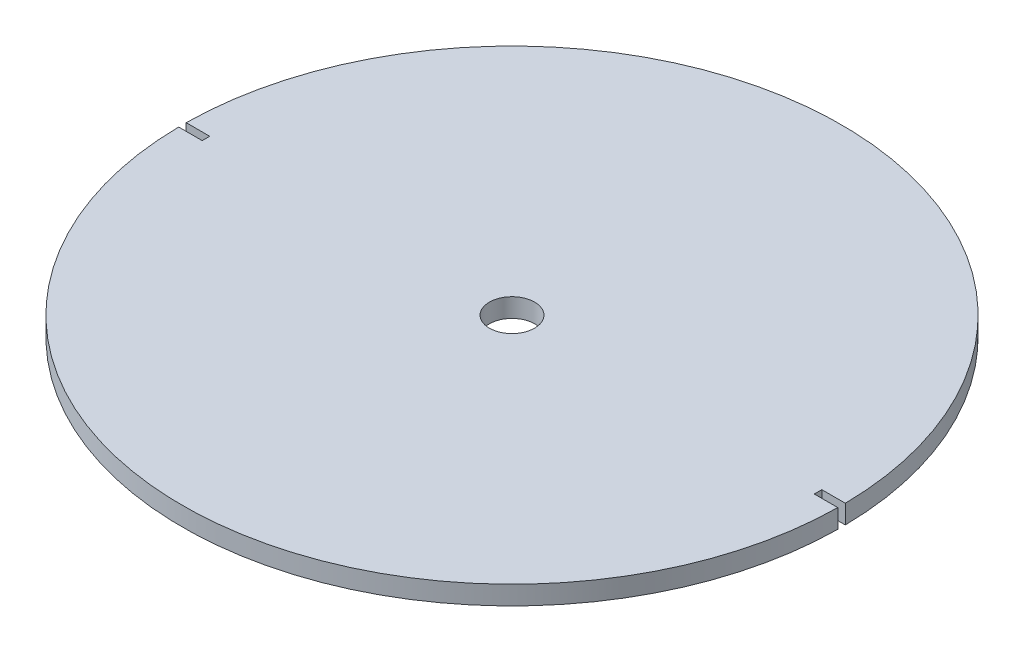
ISO-10303-21;
HEADER;
FILE_DESCRIPTION(('STEP AP214'),'2;1');
FILE_NAME('part.step','',(''),(''),'','','');
FILE_SCHEMA(('AUTOMOTIVE_DESIGN { 1 0 10303 214 1 1 1 1 }'));
ENDSEC;
DATA;
#1=APPLICATION_CONTEXT('core data for automotive mechanical design processes');
#2=APPLICATION_PROTOCOL_DEFINITION('international standard','automotive_design',2000,#1);
#3=PRODUCT_CONTEXT('',#1,'mechanical');
#4=PRODUCT('Part','Part','',(#3));
#5=PRODUCT_RELATED_PRODUCT_CATEGORY('part','',(#4));
#6=PRODUCT_DEFINITION_FORMATION('','',#4);
#7=PRODUCT_DEFINITION_CONTEXT('part definition',#1,'design');
#8=PRODUCT_DEFINITION('design','',#6,#7);
#9=PRODUCT_DEFINITION_SHAPE('','',#8);
#10=(LENGTH_UNIT() NAMED_UNIT(*) SI_UNIT(.MILLI.,.METRE.));
#11=(NAMED_UNIT(*) PLANE_ANGLE_UNIT() SI_UNIT($,.RADIAN.));
#12=(NAMED_UNIT(*) SI_UNIT($,.STERADIAN.) SOLID_ANGLE_UNIT());
#13=UNCERTAINTY_MEASURE_WITH_UNIT(LENGTH_MEASURE(1.E-05),#10,'distance_accuracy_value','');
#14=(GEOMETRIC_REPRESENTATION_CONTEXT(3) GLOBAL_UNCERTAINTY_ASSIGNED_CONTEXT((#13)) GLOBAL_UNIT_ASSIGNED_CONTEXT((#10,
#11,#12)) REPRESENTATION_CONTEXT('',''));
#15=CARTESIAN_POINT('',(0.,0.,0.));
#16=DIRECTION('',(0.,0.,1.));
#17=DIRECTION('',(1.,0.,0.));
#18=AXIS2_PLACEMENT_3D('',#15,#16,#17);
#19=CARTESIAN_POINT('',(0.,0.,0.));
#20=DIRECTION('',(0.,1.,0.));
#21=DIRECTION('',(0.,0.,1.));
#22=AXIS2_PLACEMENT_3D('',#19,#20,#21);
#23=PLANE('',#22);
#24=CARTESIAN_POINT('',(0.,0.,0.));
#25=DIRECTION('',(0.,1.,0.));
#26=DIRECTION('',(0.,0.,1.));
#27=AXIS2_PLACEMENT_3D('',#24,#25,#26);
#28=CIRCLE('',#27,2.4);
#29=CARTESIAN_POINT('',(0.,0.,2.4));
#30=VERTEX_POINT('',#29);
#31=EDGE_CURVE('E285',#30,#30,#28,.T.);
#32=ORIENTED_EDGE('',*,*,#31,.T.);
#33=EDGE_LOOP('',(#32));
#34=FACE_BOUND('',#33,.T.);
#35=DIRECTION('',(-0.866025403784439,0.,-0.5));
#36=VECTOR('',#35,1.);
#37=CARTESIAN_POINT('',(0.,0.,24.1143593539449));
#38=LINE('',#37,#36);
#39=CARTESIAN_POINT('',(0.,0.,24.1143593539449));
#40=VERTEX_POINT('',#39);
#41=CARTESIAN_POINT('',(-20.8836477965032,0.,12.0571796769724));
#42=VERTEX_POINT('',#41);
#43=EDGE_CURVE('E221',#40,#42,#38,.T.);
#44=ORIENTED_EDGE('',*,*,#43,.T.);
#45=DIRECTION('',(0.,0.,-1.));
#46=VECTOR('',#45,1.);
#47=CARTESIAN_POINT('',(-20.8836477965032,0.,12.0571796769724));
#48=LINE('',#47,#46);
#49=CARTESIAN_POINT('',(-20.8836477965032,0.,-12.0571796769724));
#50=VERTEX_POINT('',#49);
#51=EDGE_CURVE('E186',#42,#50,#48,.T.);
#52=ORIENTED_EDGE('',*,*,#51,.T.);
#53=DIRECTION('',(0.866025403784439,0.,-0.5));
#54=VECTOR('',#53,1.);
#55=CARTESIAN_POINT('',(-20.8836477965032,0.,-12.0571796769724));
#56=LINE('',#55,#54);
#57=CARTESIAN_POINT('',(0.,0.,-24.1143593539449));
#58=VERTEX_POINT('',#57);
#59=EDGE_CURVE('E66',#50,#58,#56,.T.);
#60=ORIENTED_EDGE('',*,*,#59,.T.);
#61=DIRECTION('',(0.866025403784439,0.,0.5));
#62=VECTOR('',#61,1.);
#63=CARTESIAN_POINT('',(0.,0.,-24.1143593539449));
#64=LINE('',#63,#62);
#65=CARTESIAN_POINT('',(20.8836477965032,0.,-12.0571796769724));
#66=VERTEX_POINT('',#65);
#67=EDGE_CURVE('E225',#58,#66,#64,.T.);
#68=ORIENTED_EDGE('',*,*,#67,.T.);
#69=DIRECTION('',(0.,0.,1.));
#70=VECTOR('',#69,1.);
#71=CARTESIAN_POINT('',(20.8836477965032,0.,-12.0571796769724));
#72=LINE('',#71,#70);
#73=CARTESIAN_POINT('',(20.8836477965032,0.,12.0571796769725));
#74=VERTEX_POINT('',#73);
#75=EDGE_CURVE('E210',#66,#74,#72,.T.);
#76=ORIENTED_EDGE('',*,*,#75,.T.);
#77=DIRECTION('',(-0.866025403784439,0.,0.5));
#78=VECTOR('',#77,1.);
#79=CARTESIAN_POINT('',(20.8836477965032,0.,12.0571796769725));
#80=LINE('',#79,#78);
#81=EDGE_CURVE('E207',#74,#40,#80,.T.);
#82=ORIENTED_EDGE('',*,*,#81,.T.);
#83=EDGE_LOOP('',(#44,#52,#60,#68,#76,#82));
#84=FACE_BOUND('',#83,.T.);
#85=ADVANCED_FACE('F43',(#34,#84),#23,.F.);
#86=CARTESIAN_POINT('',(0.,2.,0.));
#87=DIRECTION('',(0.,-1.,0.));
#88=DIRECTION('',(0.,0.,-1.));
#89=AXIS2_PLACEMENT_3D('',#86,#87,#88);
#90=CYLINDRICAL_SURFACE('',#89,35.);
#91=CARTESIAN_POINT('',(0.,0.,0.));
#92=DIRECTION('',(0.,1.,0.));
#93=DIRECTION('',(0.,0.,1.));
#94=AXIS2_PLACEMENT_3D('',#91,#92,#93);
#95=CIRCLE('',#94,35.);
#96=CARTESIAN_POINT('',(34.9977142110739,0.,-0.4));
#97=VERTEX_POINT('',#96);
#98=CARTESIAN_POINT('',(-34.9977142110739,0.,-0.4));
#99=VERTEX_POINT('',#98);
#100=EDGE_CURVE('E343',#97,#99,#95,.T.);
#101=ORIENTED_EDGE('',*,*,#100,.T.);
#102=DIRECTION('',(0.,-1.,0.));
#103=VECTOR('',#102,1.);
#104=CARTESIAN_POINT('',(-34.9977142110739,2.,-0.4));
#105=LINE('',#104,#103);
#106=CARTESIAN_POINT('',(-34.9977142110739,2.,-0.4));
#107=VERTEX_POINT('',#106);
#108=EDGE_CURVE('E335',#99,#107,#105,.F.);
#109=ORIENTED_EDGE('',*,*,#108,.T.);
#110=CARTESIAN_POINT('',(0.,2.,0.));
#111=DIRECTION('',(0.,1.,0.));
#112=DIRECTION('',(0.,0.,1.));
#113=AXIS2_PLACEMENT_3D('',#110,#111,#112);
#114=CIRCLE('',#113,35.);
#115=CARTESIAN_POINT('',(34.9977142110739,2.,-0.4));
#116=VERTEX_POINT('',#115);
#117=EDGE_CURVE('E342',#116,#107,#114,.T.);
#118=ORIENTED_EDGE('',*,*,#117,.F.);
#119=DIRECTION('',(0.,-1.,0.));
#120=VECTOR('',#119,1.);
#121=CARTESIAN_POINT('',(34.9977142110739,2.,-0.4));
#122=LINE('',#121,#120);
#123=EDGE_CURVE('E308',#116,#97,#122,.T.);
#124=ORIENTED_EDGE('',*,*,#123,.T.);
#125=EDGE_LOOP('',(#101,#109,#118,#124));
#126=FACE_BOUND('',#125,.T.);
#127=ADVANCED_FACE('F358',(#126),#90,.T.);
#128=CARTESIAN_POINT('',(-34.9977142110739,2.,0.4));
#129=VERTEX_POINT('',#128);
#130=CARTESIAN_POINT('',(34.9977142110739,2.,0.4));
#131=VERTEX_POINT('',#130);
#132=EDGE_CURVE('E339',#129,#131,#114,.T.);
#133=ORIENTED_EDGE('',*,*,#132,.F.);
#134=DIRECTION('',(0.,-1.,0.));
#135=VECTOR('',#134,1.);
#136=CARTESIAN_POINT('',(-34.9977142110739,2.,0.4));
#137=LINE('',#136,#135);
#138=CARTESIAN_POINT('',(-34.9977142110739,0.,0.4));
#139=VERTEX_POINT('',#138);
#140=EDGE_CURVE('E332',#129,#139,#137,.T.);
#141=ORIENTED_EDGE('',*,*,#140,.T.);
#142=CARTESIAN_POINT('',(34.9977142110739,0.,0.4));
#143=VERTEX_POINT('',#142);
#144=EDGE_CURVE('E338',#139,#143,#95,.T.);
#145=ORIENTED_EDGE('',*,*,#144,.T.);
#146=DIRECTION('',(0.,-1.,0.));
#147=VECTOR('',#146,1.);
#148=CARTESIAN_POINT('',(34.9977142110739,2.,0.4));
#149=LINE('',#148,#147);
#150=EDGE_CURVE('E329',#143,#131,#149,.F.);
#151=ORIENTED_EDGE('',*,*,#150,.T.);
#152=EDGE_LOOP('',(#133,#141,#145,#151));
#153=FACE_BOUND('',#152,.T.);
#154=ADVANCED_FACE('F45',(#153),#90,.T.);
#155=CARTESIAN_POINT('',(0.,2.,0.));
#156=DIRECTION('',(0.,1.,0.));
#157=DIRECTION('',(0.,0.,1.));
#158=AXIS2_PLACEMENT_3D('',#155,#156,#157);
#159=PLANE('',#158);
#160=CARTESIAN_POINT('',(0.,2.,0.));
#161=DIRECTION('',(0.,1.,0.));
#162=DIRECTION('',(0.,0.,1.));
#163=AXIS2_PLACEMENT_3D('',#160,#161,#162);
#164=CIRCLE('',#163,2.4);
#165=CARTESIAN_POINT('',(0.,2.,2.4));
#166=VERTEX_POINT('',#165);
#167=EDGE_CURVE('E275',#166,#166,#164,.T.);
#168=ORIENTED_EDGE('',*,*,#167,.F.);
#169=EDGE_LOOP('',(#168));
#170=FACE_BOUND('',#169,.T.);
#171=DIRECTION('',(-1.,0.,0.));
#172=VECTOR('',#171,1.);
#173=CARTESIAN_POINT('',(-37.5,2.,-0.4));
#174=LINE('',#173,#172);
#175=CARTESIAN_POINT('',(-32.5,2.,-0.4));
#176=VERTEX_POINT('',#175);
#177=EDGE_CURVE('E295',#176,#107,#174,.T.);
#178=ORIENTED_EDGE('',*,*,#177,.F.);
#179=DIRECTION('',(0.,0.,-1.));
#180=VECTOR('',#179,1.);
#181=CARTESIAN_POINT('',(-32.5,2.,-0.4));
#182=LINE('',#181,#180);
#183=CARTESIAN_POINT('',(-32.5,2.,0.4));
#184=VERTEX_POINT('',#183);
#185=EDGE_CURVE('E301',#184,#176,#182,.T.);
#186=ORIENTED_EDGE('',*,*,#185,.F.);
#187=DIRECTION('',(1.,0.,0.));
#188=VECTOR('',#187,1.);
#189=CARTESIAN_POINT('',(-37.5,2.,0.4));
#190=LINE('',#189,#188);
#191=EDGE_CURVE('E299',#129,#184,#190,.T.);
#192=ORIENTED_EDGE('',*,*,#191,.F.);
#193=ORIENTED_EDGE('',*,*,#132,.T.);
#194=DIRECTION('',(1.,0.,0.));
#195=VECTOR('',#194,1.);
#196=CARTESIAN_POINT('',(37.5,2.,0.4));
#197=LINE('',#196,#195);
#198=CARTESIAN_POINT('',(32.5,2.,0.4));
#199=VERTEX_POINT('',#198);
#200=EDGE_CURVE('E316',#199,#131,#197,.T.);
#201=ORIENTED_EDGE('',*,*,#200,.F.);
#202=DIRECTION('',(0.,0.,1.));
#203=VECTOR('',#202,1.);
#204=CARTESIAN_POINT('',(32.5,2.,-0.4));
#205=LINE('',#204,#203);
#206=CARTESIAN_POINT('',(32.5,2.,-0.4));
#207=VERTEX_POINT('',#206);
#208=EDGE_CURVE('E318',#207,#199,#205,.T.);
#209=ORIENTED_EDGE('',*,*,#208,.F.);
#210=DIRECTION('',(-1.,0.,0.));
#211=VECTOR('',#210,1.);
#212=CARTESIAN_POINT('',(37.5,2.,-0.4));
#213=LINE('',#212,#211);
#214=EDGE_CURVE('E302',#116,#207,#213,.T.);
#215=ORIENTED_EDGE('',*,*,#214,.F.);
#216=ORIENTED_EDGE('',*,*,#117,.T.);
#217=EDGE_LOOP('',(#178,#186,#192,#193,#201,#209,#215,#216));
#218=FACE_BOUND('',#217,.T.);
#219=ADVANCED_FACE('F353',(#170,#218),#159,.T.);
#220=DIRECTION('',(0.,0.,-1.));
#221=VECTOR('',#220,1.);
#222=CARTESIAN_POINT('',(-22.0836477965032,0.,12.75));
#223=LINE('',#222,#221);
#224=CARTESIAN_POINT('',(-22.0836477965032,0.,12.75));
#225=VERTEX_POINT('',#224);
#226=CARTESIAN_POINT('',(-22.0836477965032,0.,-12.75));
#227=VERTEX_POINT('',#226);
#228=EDGE_CURVE('E259',#225,#227,#223,.T.);
#229=ORIENTED_EDGE('',*,*,#228,.F.);
#230=DIRECTION('',(-0.866025403784439,0.,-0.5));
#231=VECTOR('',#230,1.);
#232=CARTESIAN_POINT('',(0.,0.,25.5));
#233=LINE('',#232,#231);
#234=CARTESIAN_POINT('',(0.,0.,25.5));
#235=VERTEX_POINT('',#234);
#236=EDGE_CURVE('E58',#235,#225,#233,.T.);
#237=ORIENTED_EDGE('',*,*,#236,.F.);
#238=DIRECTION('',(-0.866025403784439,0.,0.5));
#239=VECTOR('',#238,1.);
#240=CARTESIAN_POINT('',(22.0836477965032,0.,12.75));
#241=LINE('',#240,#239);
#242=CARTESIAN_POINT('',(22.0836477965032,0.,12.75));
#243=VERTEX_POINT('',#242);
#244=EDGE_CURVE('E242',#243,#235,#241,.T.);
#245=ORIENTED_EDGE('',*,*,#244,.F.);
#246=DIRECTION('',(0.,0.,1.));
#247=VECTOR('',#246,1.);
#248=CARTESIAN_POINT('',(22.0836477965032,0.,-12.75));
#249=LINE('',#248,#247);
#250=CARTESIAN_POINT('',(22.0836477965032,0.,-12.75));
#251=VERTEX_POINT('',#250);
#252=EDGE_CURVE('E268',#251,#243,#249,.T.);
#253=ORIENTED_EDGE('',*,*,#252,.F.);
#254=DIRECTION('',(0.866025403784439,0.,0.5));
#255=VECTOR('',#254,1.);
#256=CARTESIAN_POINT('',(0.,0.,-25.5));
#257=LINE('',#256,#255);
#258=CARTESIAN_POINT('',(0.,0.,-25.5));
#259=VERTEX_POINT('',#258);
#260=EDGE_CURVE('E265',#259,#251,#257,.T.);
#261=ORIENTED_EDGE('',*,*,#260,.F.);
#262=DIRECTION('',(0.866025403784439,0.,-0.5));
#263=VECTOR('',#262,1.);
#264=CARTESIAN_POINT('',(-22.0836477965032,0.,-12.75));
#265=LINE('',#264,#263);
#266=EDGE_CURVE('E262',#227,#259,#265,.T.);
#267=ORIENTED_EDGE('',*,*,#266,.F.);
#268=EDGE_LOOP('',(#229,#237,#245,#253,#261,#267));
#269=FACE_BOUND('',#268,.T.);
#270=DIRECTION('',(0.,0.,-1.));
#271=VECTOR('',#270,1.);
#272=CARTESIAN_POINT('',(-32.5,0.,-0.4));
#273=LINE('',#272,#271);
#274=CARTESIAN_POINT('',(-32.5,0.,0.4));
#275=VERTEX_POINT('',#274);
#276=CARTESIAN_POINT('',(-32.5,0.,-0.4));
#277=VERTEX_POINT('',#276);
#278=EDGE_CURVE('E291',#275,#277,#273,.T.);
#279=ORIENTED_EDGE('',*,*,#278,.T.);
#280=DIRECTION('',(-1.,0.,0.));
#281=VECTOR('',#280,1.);
#282=CARTESIAN_POINT('',(-37.5,0.,-0.4));
#283=LINE('',#282,#281);
#284=EDGE_CURVE('E294',#277,#99,#283,.T.);
#285=ORIENTED_EDGE('',*,*,#284,.T.);
#286=ORIENTED_EDGE('',*,*,#100,.F.);
#287=DIRECTION('',(-1.,0.,0.));
#288=VECTOR('',#287,1.);
#289=CARTESIAN_POINT('',(0.,0.,-0.4));
#290=LINE('',#289,#288);
#291=CARTESIAN_POINT('',(32.5,0.,-0.4));
#292=VERTEX_POINT('',#291);
#293=EDGE_CURVE('E51',#97,#292,#290,.T.);
#294=ORIENTED_EDGE('',*,*,#293,.T.);
#295=DIRECTION('',(0.,0.,1.));
#296=VECTOR('',#295,1.);
#297=CARTESIAN_POINT('',(32.5,0.,-0.4));
#298=LINE('',#297,#296);
#299=CARTESIAN_POINT('',(32.5,0.,0.4));
#300=VERTEX_POINT('',#299);
#301=EDGE_CURVE('E319',#292,#300,#298,.T.);
#302=ORIENTED_EDGE('',*,*,#301,.T.);
#303=DIRECTION('',(1.,0.,0.));
#304=VECTOR('',#303,1.);
#305=CARTESIAN_POINT('',(37.5,0.,0.4));
#306=LINE('',#305,#304);
#307=EDGE_CURVE('E314',#300,#143,#306,.T.);
#308=ORIENTED_EDGE('',*,*,#307,.T.);
#309=ORIENTED_EDGE('',*,*,#144,.F.);
#310=DIRECTION('',(1.,0.,0.));
#311=VECTOR('',#310,1.);
#312=CARTESIAN_POINT('',(0.,0.,0.4));
#313=LINE('',#312,#311);
#314=EDGE_CURVE('E11',#139,#275,#313,.T.);
#315=ORIENTED_EDGE('',*,*,#314,.T.);
#316=EDGE_LOOP('',(#279,#285,#286,#294,#302,#308,#309,#315));
#317=FACE_BOUND('',#316,.T.);
#318=ADVANCED_FACE('F362',(#269,#317),#23,.F.);
#319=CARTESIAN_POINT('',(37.5,0.,0.4));
#320=DIRECTION('',(0.,0.,1.));
#321=DIRECTION('',(1.,0.,0.));
#322=AXIS2_PLACEMENT_3D('',#319,#320,#321);
#323=PLANE('',#322);
#324=ORIENTED_EDGE('',*,*,#307,.F.);
#325=DIRECTION('',(0.,1.,0.));
#326=VECTOR('',#325,1.);
#327=CARTESIAN_POINT('',(32.5,0.,0.4));
#328=LINE('',#327,#326);
#329=EDGE_CURVE('E288',#300,#199,#328,.T.);
#330=ORIENTED_EDGE('',*,*,#329,.T.);
#331=ORIENTED_EDGE('',*,*,#200,.T.);
#332=ORIENTED_EDGE('',*,*,#150,.F.);
#333=EDGE_LOOP('',(#324,#330,#331,#332));
#334=FACE_BOUND('',#333,.T.);
#335=ADVANCED_FACE('F375',(#334),#323,.F.);
#336=CARTESIAN_POINT('',(37.5,0.,-0.4));
#337=DIRECTION('',(0.,0.,-1.));
#338=DIRECTION('',(-1.,0.,0.));
#339=AXIS2_PLACEMENT_3D('',#336,#337,#338);
#340=PLANE('',#339);
#341=ORIENTED_EDGE('',*,*,#214,.T.);
#342=DIRECTION('',(0.,1.,0.));
#343=VECTOR('',#342,1.);
#344=CARTESIAN_POINT('',(32.5,0.,-0.4));
#345=LINE('',#344,#343);
#346=EDGE_CURVE('E311',#292,#207,#345,.T.);
#347=ORIENTED_EDGE('',*,*,#346,.F.);
#348=ORIENTED_EDGE('',*,*,#293,.F.);
#349=ORIENTED_EDGE('',*,*,#123,.F.);
#350=EDGE_LOOP('',(#341,#347,#348,#349));
#351=FACE_BOUND('',#350,.T.);
#352=ADVANCED_FACE('F380',(#351),#340,.F.);
#353=CARTESIAN_POINT('',(32.5,0.,-0.4));
#354=DIRECTION('',(-1.,0.,0.));
#355=DIRECTION('',(0.,0.,1.));
#356=AXIS2_PLACEMENT_3D('',#353,#354,#355);
#357=PLANE('',#356);
#358=ORIENTED_EDGE('',*,*,#208,.T.);
#359=ORIENTED_EDGE('',*,*,#329,.F.);
#360=ORIENTED_EDGE('',*,*,#301,.F.);
#361=ORIENTED_EDGE('',*,*,#346,.T.);
#362=EDGE_LOOP('',(#358,#359,#360,#361));
#363=FACE_BOUND('',#362,.T.);
#364=ADVANCED_FACE('F378',(#363),#357,.F.);
#365=CARTESIAN_POINT('',(-37.5,0.,-0.4));
#366=DIRECTION('',(0.,0.,-1.));
#367=DIRECTION('',(-1.,0.,0.));
#368=AXIS2_PLACEMENT_3D('',#365,#366,#367);
#369=PLANE('',#368);
#370=ORIENTED_EDGE('',*,*,#284,.F.);
#371=DIRECTION('',(0.,1.,0.));
#372=VECTOR('',#371,1.);
#373=CARTESIAN_POINT('',(-32.5,0.,-0.4));
#374=LINE('',#373,#372);
#375=EDGE_CURVE('E306',#277,#176,#374,.T.);
#376=ORIENTED_EDGE('',*,*,#375,.T.);
#377=ORIENTED_EDGE('',*,*,#177,.T.);
#378=ORIENTED_EDGE('',*,*,#108,.F.);
#379=EDGE_LOOP('',(#370,#376,#377,#378));
#380=FACE_BOUND('',#379,.T.);
#381=ADVANCED_FACE('F361',(#380),#369,.F.);
#382=CARTESIAN_POINT('',(-37.5,0.,0.4));
#383=DIRECTION('',(0.,0.,1.));
#384=DIRECTION('',(1.,0.,0.));
#385=AXIS2_PLACEMENT_3D('',#382,#383,#384);
#386=PLANE('',#385);
#387=ORIENTED_EDGE('',*,*,#191,.T.);
#388=DIRECTION('',(0.,1.,0.));
#389=VECTOR('',#388,1.);
#390=CARTESIAN_POINT('',(-32.5,0.,0.4));
#391=LINE('',#390,#389);
#392=EDGE_CURVE('E298',#275,#184,#391,.T.);
#393=ORIENTED_EDGE('',*,*,#392,.F.);
#394=ORIENTED_EDGE('',*,*,#314,.F.);
#395=ORIENTED_EDGE('',*,*,#140,.F.);
#396=EDGE_LOOP('',(#387,#393,#394,#395));
#397=FACE_BOUND('',#396,.T.);
#398=ADVANCED_FACE('F368',(#397),#386,.F.);
#399=CARTESIAN_POINT('',(-32.5,0.,-0.4));
#400=DIRECTION('',(1.,0.,0.));
#401=DIRECTION('',(0.,0.,-1.));
#402=AXIS2_PLACEMENT_3D('',#399,#400,#401);
#403=PLANE('',#402);
#404=ORIENTED_EDGE('',*,*,#185,.T.);
#405=ORIENTED_EDGE('',*,*,#375,.F.);
#406=ORIENTED_EDGE('',*,*,#278,.F.);
#407=ORIENTED_EDGE('',*,*,#392,.T.);
#408=EDGE_LOOP('',(#404,#405,#406,#407));
#409=FACE_BOUND('',#408,.T.);
#410=ADVANCED_FACE('F366',(#409),#403,.F.);
#411=CARTESIAN_POINT('',(0.,0.,0.));
#412=DIRECTION('',(0.,1.,0.));
#413=DIRECTION('',(0.,0.,1.));
#414=AXIS2_PLACEMENT_3D('',#411,#412,#413);
#415=CYLINDRICAL_SURFACE('',#414,2.4);
#416=ORIENTED_EDGE('',*,*,#31,.F.);
#417=EDGE_LOOP('',(#416));
#418=FACE_BOUND('',#417,.T.);
#419=ORIENTED_EDGE('',*,*,#167,.T.);
#420=EDGE_LOOP('',(#419));
#421=FACE_BOUND('',#420,.T.);
#422=ADVANCED_FACE('F437',(#418,#421),#415,.F.);
#423=CARTESIAN_POINT('',(0.,1.,25.5));
#424=DIRECTION('',(-0.5,0.,0.866025403784439));
#425=DIRECTION('',(0.866025403784439,0.,0.5));
#426=AXIS2_PLACEMENT_3D('',#423,#424,#425);
#427=PLANE('',#426);
#428=ORIENTED_EDGE('',*,*,#236,.T.);
#429=DIRECTION('',(0.,-1.,0.));
#430=VECTOR('',#429,1.);
#431=CARTESIAN_POINT('',(-22.0836477965032,1.,12.75));
#432=LINE('',#431,#430);
#433=CARTESIAN_POINT('',(-22.0836477965032,1.,12.75));
#434=VERTEX_POINT('',#433);
#435=EDGE_CURVE('E257',#434,#225,#432,.T.);
#436=ORIENTED_EDGE('',*,*,#435,.F.);
#437=DIRECTION('',(-0.866025403784439,0.,-0.5));
#438=VECTOR('',#437,1.);
#439=CARTESIAN_POINT('',(0.,1.,25.5));
#440=LINE('',#439,#438);
#441=CARTESIAN_POINT('',(0.,1.,25.5));
#442=VERTEX_POINT('',#441);
#443=EDGE_CURVE('E238',#442,#434,#440,.T.);
#444=ORIENTED_EDGE('',*,*,#443,.F.);
#445=DIRECTION('',(0.,-1.,0.));
#446=VECTOR('',#445,1.);
#447=CARTESIAN_POINT('',(0.,1.,25.5));
#448=LINE('',#447,#446);
#449=EDGE_CURVE('E273',#442,#235,#448,.T.);
#450=ORIENTED_EDGE('',*,*,#449,.T.);
#451=EDGE_LOOP('',(#428,#436,#444,#450));
#452=FACE_BOUND('',#451,.T.);
#453=ADVANCED_FACE('F412',(#452),#427,.F.);
#454=CARTESIAN_POINT('',(22.0836477965032,1.,12.75));
#455=DIRECTION('',(0.5,0.,0.866025403784439));
#456=DIRECTION('',(0.866025403784439,0.,-0.5));
#457=AXIS2_PLACEMENT_3D('',#454,#455,#456);
#458=PLANE('',#457);
#459=ORIENTED_EDGE('',*,*,#244,.T.);
#460=ORIENTED_EDGE('',*,*,#449,.F.);
#461=DIRECTION('',(-0.866025403784439,0.,0.5));
#462=VECTOR('',#461,1.);
#463=CARTESIAN_POINT('',(22.0836477965032,1.,12.75));
#464=LINE('',#463,#462);
#465=CARTESIAN_POINT('',(22.0836477965032,1.,12.75));
#466=VERTEX_POINT('',#465);
#467=EDGE_CURVE('E254',#466,#442,#464,.T.);
#468=ORIENTED_EDGE('',*,*,#467,.F.);
#469=DIRECTION('',(0.,-1.,0.));
#470=VECTOR('',#469,1.);
#471=CARTESIAN_POINT('',(22.0836477965032,1.,12.75));
#472=LINE('',#471,#470);
#473=EDGE_CURVE('E276',#466,#243,#472,.T.);
#474=ORIENTED_EDGE('',*,*,#473,.T.);
#475=EDGE_LOOP('',(#459,#460,#468,#474));
#476=FACE_BOUND('',#475,.T.);
#477=ADVANCED_FACE('F416',(#476),#458,.F.);
#478=CARTESIAN_POINT('',(22.0836477965032,1.,-12.75));
#479=DIRECTION('',(1.,0.,0.));
#480=DIRECTION('',(0.,0.,-1.));
#481=AXIS2_PLACEMENT_3D('',#478,#479,#480);
#482=PLANE('',#481);
#483=ORIENTED_EDGE('',*,*,#252,.T.);
#484=ORIENTED_EDGE('',*,*,#473,.F.);
#485=DIRECTION('',(0.,0.,1.));
#486=VECTOR('',#485,1.);
#487=CARTESIAN_POINT('',(22.0836477965032,1.,-12.75));
#488=LINE('',#487,#486);
#489=CARTESIAN_POINT('',(22.0836477965032,1.,-12.75));
#490=VERTEX_POINT('',#489);
#491=EDGE_CURVE('E251',#490,#466,#488,.T.);
#492=ORIENTED_EDGE('',*,*,#491,.F.);
#493=DIRECTION('',(0.,-1.,0.));
#494=VECTOR('',#493,1.);
#495=CARTESIAN_POINT('',(22.0836477965032,1.,-12.75));
#496=LINE('',#495,#494);
#497=EDGE_CURVE('E278',#490,#251,#496,.T.);
#498=ORIENTED_EDGE('',*,*,#497,.T.);
#499=EDGE_LOOP('',(#483,#484,#492,#498));
#500=FACE_BOUND('',#499,.T.);
#501=ADVANCED_FACE('F419',(#500),#482,.F.);
#502=CARTESIAN_POINT('',(0.,1.,-25.5));
#503=DIRECTION('',(0.5,0.,-0.866025403784439));
#504=DIRECTION('',(-0.866025403784439,0.,-0.5));
#505=AXIS2_PLACEMENT_3D('',#502,#503,#504);
#506=PLANE('',#505);
#507=ORIENTED_EDGE('',*,*,#260,.T.);
#508=ORIENTED_EDGE('',*,*,#497,.F.);
#509=DIRECTION('',(0.866025403784439,0.,0.5));
#510=VECTOR('',#509,1.);
#511=CARTESIAN_POINT('',(0.,1.,-25.5));
#512=LINE('',#511,#510);
#513=CARTESIAN_POINT('',(0.,1.,-25.5));
#514=VERTEX_POINT('',#513);
#515=EDGE_CURVE('E248',#514,#490,#512,.T.);
#516=ORIENTED_EDGE('',*,*,#515,.F.);
#517=DIRECTION('',(0.,-1.,0.));
#518=VECTOR('',#517,1.);
#519=CARTESIAN_POINT('',(0.,1.,-25.5));
#520=LINE('',#519,#518);
#521=EDGE_CURVE('E280',#514,#259,#520,.T.);
#522=ORIENTED_EDGE('',*,*,#521,.T.);
#523=EDGE_LOOP('',(#507,#508,#516,#522));
#524=FACE_BOUND('',#523,.T.);
#525=ADVANCED_FACE('F422',(#524),#506,.F.);
#526=CARTESIAN_POINT('',(-22.0836477965032,1.,-12.75));
#527=DIRECTION('',(-0.5,0.,-0.866025403784439));
#528=DIRECTION('',(-0.866025403784439,0.,0.5));
#529=AXIS2_PLACEMENT_3D('',#526,#527,#528);
#530=PLANE('',#529);
#531=ORIENTED_EDGE('',*,*,#266,.T.);
#532=ORIENTED_EDGE('',*,*,#521,.F.);
#533=DIRECTION('',(0.866025403784439,0.,-0.5));
#534=VECTOR('',#533,1.);
#535=CARTESIAN_POINT('',(-22.0836477965032,1.,-12.75));
#536=LINE('',#535,#534);
#537=CARTESIAN_POINT('',(-22.0836477965032,1.,-12.75));
#538=VERTEX_POINT('',#537);
#539=EDGE_CURVE('E245',#538,#514,#536,.T.);
#540=ORIENTED_EDGE('',*,*,#539,.F.);
#541=DIRECTION('',(0.,-1.,0.));
#542=VECTOR('',#541,1.);
#543=CARTESIAN_POINT('',(-22.0836477965032,1.,-12.75));
#544=LINE('',#543,#542);
#545=EDGE_CURVE('E282',#538,#227,#544,.T.);
#546=ORIENTED_EDGE('',*,*,#545,.T.);
#547=EDGE_LOOP('',(#531,#532,#540,#546));
#548=FACE_BOUND('',#547,.T.);
#549=ADVANCED_FACE('F424',(#548),#530,.F.);
#550=CARTESIAN_POINT('',(-22.0836477965032,1.,12.75));
#551=DIRECTION('',(-1.,0.,0.));
#552=DIRECTION('',(0.,0.,1.));
#553=AXIS2_PLACEMENT_3D('',#550,#551,#552);
#554=PLANE('',#553);
#555=ORIENTED_EDGE('',*,*,#228,.T.);
#556=ORIENTED_EDGE('',*,*,#545,.F.);
#557=DIRECTION('',(0.,0.,-1.));
#558=VECTOR('',#557,1.);
#559=CARTESIAN_POINT('',(-22.0836477965032,1.,12.75));
#560=LINE('',#559,#558);
#561=EDGE_CURVE('E241',#434,#538,#560,.T.);
#562=ORIENTED_EDGE('',*,*,#561,.F.);
#563=ORIENTED_EDGE('',*,*,#435,.T.);
#564=EDGE_LOOP('',(#555,#556,#562,#563));
#565=FACE_BOUND('',#564,.T.);
#566=ADVANCED_FACE('F408',(#565),#554,.F.);
#567=CARTESIAN_POINT('',(0.,1.,0.));
#568=DIRECTION('',(0.,-1.,0.));
#569=DIRECTION('',(0.,0.,-1.));
#570=AXIS2_PLACEMENT_3D('',#567,#568,#569);
#571=PLANE('',#570);
#572=DIRECTION('',(-0.866025403784439,0.,0.5));
#573=VECTOR('',#572,1.);
#574=CARTESIAN_POINT('',(20.8836477965032,1.,12.0571796769725));
#575=LINE('',#574,#573);
#576=CARTESIAN_POINT('',(20.8836477965032,1.,12.0571796769725));
#577=VERTEX_POINT('',#576);
#578=CARTESIAN_POINT('',(0.,1.,24.1143593539449));
#579=VERTEX_POINT('',#578);
#580=EDGE_CURVE('E192',#577,#579,#575,.T.);
#581=ORIENTED_EDGE('',*,*,#580,.F.);
#582=DIRECTION('',(0.,0.,1.));
#583=VECTOR('',#582,1.);
#584=CARTESIAN_POINT('',(20.8836477965032,1.,-12.0571796769724));
#585=LINE('',#584,#583);
#586=CARTESIAN_POINT('',(20.8836477965032,1.,-12.0571796769724));
#587=VERTEX_POINT('',#586);
#588=EDGE_CURVE('E217',#587,#577,#585,.T.);
#589=ORIENTED_EDGE('',*,*,#588,.F.);
#590=DIRECTION('',(0.866025403784439,0.,0.5));
#591=VECTOR('',#590,1.);
#592=CARTESIAN_POINT('',(0.,1.,-24.1143593539449));
#593=LINE('',#592,#591);
#594=CARTESIAN_POINT('',(0.,1.,-24.1143593539449));
#595=VERTEX_POINT('',#594);
#596=EDGE_CURVE('E214',#595,#587,#593,.T.);
#597=ORIENTED_EDGE('',*,*,#596,.F.);
#598=DIRECTION('',(0.866025403784439,0.,-0.5));
#599=VECTOR('',#598,1.);
#600=CARTESIAN_POINT('',(-20.8836477965032,1.,-12.0571796769724));
#601=LINE('',#600,#599);
#602=CARTESIAN_POINT('',(-20.8836477965032,1.,-12.0571796769724));
#603=VERTEX_POINT('',#602);
#604=EDGE_CURVE('E203',#603,#595,#601,.T.);
#605=ORIENTED_EDGE('',*,*,#604,.F.);
#606=DIRECTION('',(0.,0.,-1.));
#607=VECTOR('',#606,1.);
#608=CARTESIAN_POINT('',(-20.8836477965032,1.,12.0571796769724));
#609=LINE('',#608,#607);
#610=CARTESIAN_POINT('',(-20.8836477965032,1.,12.0571796769724));
#611=VERTEX_POINT('',#610);
#612=EDGE_CURVE('E184',#611,#603,#609,.T.);
#613=ORIENTED_EDGE('',*,*,#612,.F.);
#614=DIRECTION('',(-0.866025403784439,0.,-0.5));
#615=VECTOR('',#614,1.);
#616=CARTESIAN_POINT('',(0.,1.,24.1143593539449));
#617=LINE('',#616,#615);
#618=EDGE_CURVE('E199',#579,#611,#617,.T.);
#619=ORIENTED_EDGE('',*,*,#618,.F.);
#620=EDGE_LOOP('',(#581,#589,#597,#605,#613,#619));
#621=FACE_BOUND('',#620,.T.);
#622=ORIENTED_EDGE('',*,*,#443,.T.);
#623=ORIENTED_EDGE('',*,*,#561,.T.);
#624=ORIENTED_EDGE('',*,*,#539,.T.);
#625=ORIENTED_EDGE('',*,*,#515,.T.);
#626=ORIENTED_EDGE('',*,*,#491,.T.);
#627=ORIENTED_EDGE('',*,*,#467,.T.);
#628=EDGE_LOOP('',(#622,#623,#624,#625,#626,#627));
#629=FACE_BOUND('',#628,.T.);
#630=ADVANCED_FACE('F197',(#621,#629),#571,.T.);
#631=CARTESIAN_POINT('',(0.,1.,24.1143593539449));
#632=DIRECTION('',(-0.5,0.,0.866025403784439));
#633=DIRECTION('',(0.866025403784439,0.,0.5));
#634=AXIS2_PLACEMENT_3D('',#631,#632,#633);
#635=PLANE('',#634);
#636=ORIENTED_EDGE('',*,*,#43,.F.);
#637=DIRECTION('',(0.,-1.,0.));
#638=VECTOR('',#637,1.);
#639=CARTESIAN_POINT('',(0.,1.,24.1143593539449));
#640=LINE('',#639,#638);
#641=EDGE_CURVE('E206',#579,#40,#640,.T.);
#642=ORIENTED_EDGE('',*,*,#641,.F.);
#643=ORIENTED_EDGE('',*,*,#618,.T.);
#644=DIRECTION('',(0.,-1.,0.));
#645=VECTOR('',#644,1.);
#646=CARTESIAN_POINT('',(-20.8836477965032,1.,12.0571796769724));
#647=LINE('',#646,#645);
#648=EDGE_CURVE('E181',#611,#42,#647,.T.);
#649=ORIENTED_EDGE('',*,*,#648,.T.);
#650=EDGE_LOOP('',(#636,#642,#643,#649));
#651=FACE_BOUND('',#650,.T.);
#652=ADVANCED_FACE('F205',(#651),#635,.T.);
#653=CARTESIAN_POINT('',(20.8836477965032,1.,12.0571796769725));
#654=DIRECTION('',(0.5,0.,0.866025403784439));
#655=DIRECTION('',(0.866025403784439,0.,-0.5));
#656=AXIS2_PLACEMENT_3D('',#653,#654,#655);
#657=PLANE('',#656);
#658=ORIENTED_EDGE('',*,*,#81,.F.);
#659=DIRECTION('',(0.,-1.,0.));
#660=VECTOR('',#659,1.);
#661=CARTESIAN_POINT('',(20.8836477965032,1.,12.0571796769725));
#662=LINE('',#661,#660);
#663=EDGE_CURVE('E231',#577,#74,#662,.T.);
#664=ORIENTED_EDGE('',*,*,#663,.F.);
#665=ORIENTED_EDGE('',*,*,#580,.T.);
#666=ORIENTED_EDGE('',*,*,#641,.T.);
#667=EDGE_LOOP('',(#658,#664,#665,#666));
#668=FACE_BOUND('',#667,.T.);
#669=ADVANCED_FACE('F508',(#668),#657,.T.);
#670=CARTESIAN_POINT('',(20.8836477965032,1.,-12.0571796769724));
#671=DIRECTION('',(1.,0.,0.));
#672=DIRECTION('',(0.,0.,-1.));
#673=AXIS2_PLACEMENT_3D('',#670,#671,#672);
#674=PLANE('',#673);
#675=ORIENTED_EDGE('',*,*,#75,.F.);
#676=DIRECTION('',(0.,-1.,0.));
#677=VECTOR('',#676,1.);
#678=CARTESIAN_POINT('',(20.8836477965032,1.,-12.0571796769724));
#679=LINE('',#678,#677);
#680=EDGE_CURVE('E233',#587,#66,#679,.T.);
#681=ORIENTED_EDGE('',*,*,#680,.F.);
#682=ORIENTED_EDGE('',*,*,#588,.T.);
#683=ORIENTED_EDGE('',*,*,#663,.T.);
#684=EDGE_LOOP('',(#675,#681,#682,#683));
#685=FACE_BOUND('',#684,.T.);
#686=ADVANCED_FACE('F518',(#685),#674,.T.);
#687=CARTESIAN_POINT('',(0.,1.,-24.1143593539449));
#688=DIRECTION('',(0.5,0.,-0.866025403784439));
#689=DIRECTION('',(-0.866025403784439,0.,-0.5));
#690=AXIS2_PLACEMENT_3D('',#687,#688,#689);
#691=PLANE('',#690);
#692=ORIENTED_EDGE('',*,*,#67,.F.);
#693=DIRECTION('',(0.,-1.,0.));
#694=VECTOR('',#693,1.);
#695=CARTESIAN_POINT('',(0.,1.,-24.1143593539449));
#696=LINE('',#695,#694);
#697=EDGE_CURVE('E235',#595,#58,#696,.T.);
#698=ORIENTED_EDGE('',*,*,#697,.F.);
#699=ORIENTED_EDGE('',*,*,#596,.T.);
#700=ORIENTED_EDGE('',*,*,#680,.T.);
#701=EDGE_LOOP('',(#692,#698,#699,#700));
#702=FACE_BOUND('',#701,.T.);
#703=ADVANCED_FACE('F529',(#702),#691,.T.);
#704=CARTESIAN_POINT('',(-20.8836477965032,1.,-12.0571796769724));
#705=DIRECTION('',(-0.5,0.,-0.866025403784439));
#706=DIRECTION('',(-0.866025403784439,0.,0.5));
#707=AXIS2_PLACEMENT_3D('',#704,#705,#706);
#708=PLANE('',#707);
#709=ORIENTED_EDGE('',*,*,#59,.F.);
#710=DIRECTION('',(0.,-1.,0.));
#711=VECTOR('',#710,1.);
#712=CARTESIAN_POINT('',(-20.8836477965032,1.,-12.0571796769724));
#713=LINE('',#712,#711);
#714=EDGE_CURVE('E191',#603,#50,#713,.T.);
#715=ORIENTED_EDGE('',*,*,#714,.F.);
#716=ORIENTED_EDGE('',*,*,#604,.T.);
#717=ORIENTED_EDGE('',*,*,#697,.T.);
#718=EDGE_LOOP('',(#709,#715,#716,#717));
#719=FACE_BOUND('',#718,.T.);
#720=ADVANCED_FACE('F540',(#719),#708,.T.);
#721=CARTESIAN_POINT('',(-20.8836477965032,1.,12.0571796769724));
#722=DIRECTION('',(-1.,0.,0.));
#723=DIRECTION('',(0.,0.,1.));
#724=AXIS2_PLACEMENT_3D('',#721,#722,#723);
#725=PLANE('',#724);
#726=ORIENTED_EDGE('',*,*,#51,.F.);
#727=ORIENTED_EDGE('',*,*,#648,.F.);
#728=ORIENTED_EDGE('',*,*,#612,.T.);
#729=ORIENTED_EDGE('',*,*,#714,.T.);
#730=EDGE_LOOP('',(#726,#727,#728,#729));
#731=FACE_BOUND('',#730,.T.);
#732=ADVANCED_FACE('F183',(#731),#725,.T.);
#733=CLOSED_SHELL('',(#85,#127,#154,#219,#318,#335,#352,#364,#381,#398,#410,#422,#453,#477,#501,
#525,#549,#566,#630,#652,#669,#686,#703,#720,#732));
#734=MANIFOLD_SOLID_BREP('B2',#733);
#735=ADVANCED_BREP_SHAPE_REPRESENTATION('',(#18,#734),#14);
#736=SHAPE_DEFINITION_REPRESENTATION(#9,#735);
ENDSEC;
END-ISO-10303-21;
